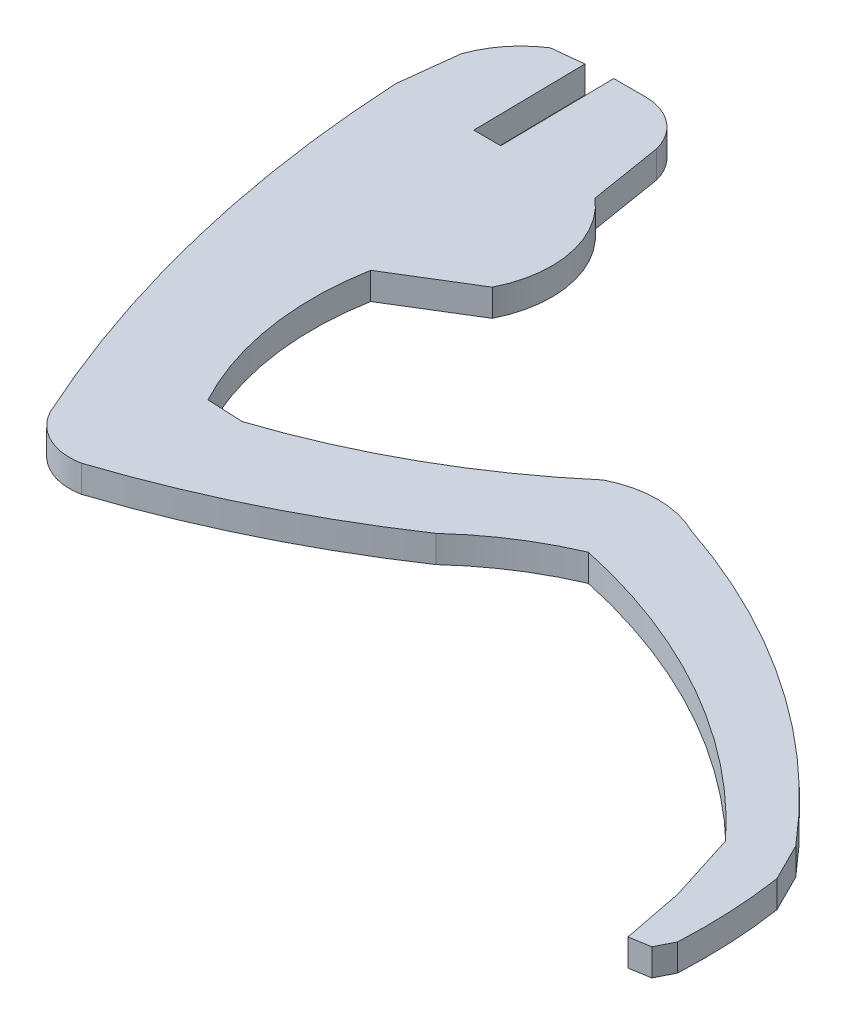
ISO-10303-21;
HEADER;
FILE_DESCRIPTION(('STEP AP214'),'2;1');
FILE_NAME('part.step','',(''),(''),'','','');
FILE_SCHEMA(('AUTOMOTIVE_DESIGN { 1 0 10303 214 1 1 1 1 }'));
ENDSEC;
DATA;
#1=APPLICATION_CONTEXT('core data for automotive mechanical design processes');
#2=APPLICATION_PROTOCOL_DEFINITION('international standard','automotive_design',2000,#1);
#3=PRODUCT_CONTEXT('',#1,'mechanical');
#4=PRODUCT('Part','Part','',(#3));
#5=PRODUCT_RELATED_PRODUCT_CATEGORY('part','',(#4));
#6=PRODUCT_DEFINITION_FORMATION('','',#4);
#7=PRODUCT_DEFINITION_CONTEXT('part definition',#1,'design');
#8=PRODUCT_DEFINITION('design','',#6,#7);
#9=PRODUCT_DEFINITION_SHAPE('','',#8);
#10=(LENGTH_UNIT() NAMED_UNIT(*) SI_UNIT(.MILLI.,.METRE.));
#11=(NAMED_UNIT(*) PLANE_ANGLE_UNIT() SI_UNIT($,.RADIAN.));
#12=(NAMED_UNIT(*) SI_UNIT($,.STERADIAN.) SOLID_ANGLE_UNIT());
#13=UNCERTAINTY_MEASURE_WITH_UNIT(LENGTH_MEASURE(1.E-05),#10,'distance_accuracy_value','');
#14=(GEOMETRIC_REPRESENTATION_CONTEXT(3) GLOBAL_UNCERTAINTY_ASSIGNED_CONTEXT((#13)) GLOBAL_UNIT_ASSIGNED_CONTEXT((#10,
#11,#12)) REPRESENTATION_CONTEXT('',''));
#15=CARTESIAN_POINT('',(0.,0.,0.));
#16=DIRECTION('',(0.,0.,1.));
#17=DIRECTION('',(1.,0.,0.));
#18=AXIS2_PLACEMENT_3D('',#15,#16,#17);
#19=CARTESIAN_POINT('',(-95.5605399999783,2.,-479.968799999999));
#20=DIRECTION('',(0.993149487101542,0.,0.116850743557512));
#21=DIRECTION('',(0.116850743557512,0.,-0.993149487101542));
#22=AXIS2_PLACEMENT_3D('',#19,#20,#21);
#23=PLANE('',#22);
#24=DIRECTION('',(-0.116850743557512,0.,0.993149487101542));
#25=VECTOR('',#24,1.);
#26=CARTESIAN_POINT('',(-95.5605399999783,0.,-479.968799999999));
#27=LINE('',#26,#25);
#28=CARTESIAN_POINT('',(-95.5605399999783,0.,-479.968799999999));
#29=VERTEX_POINT('',#28);
#30=CARTESIAN_POINT('',(-96.06745,0.,-475.66042));
#31=VERTEX_POINT('',#30);
#32=EDGE_CURVE('E11',#29,#31,#27,.T.);
#33=ORIENTED_EDGE('',*,*,#32,.T.);
#34=DIRECTION('',(0.,-1.,0.));
#35=VECTOR('',#34,1.);
#36=CARTESIAN_POINT('',(-96.06745,2.,-475.66042));
#37=LINE('',#36,#35);
#38=CARTESIAN_POINT('',(-96.06745,2.,-475.66042));
#39=VERTEX_POINT('',#38);
#40=EDGE_CURVE('E754',#39,#31,#37,.T.);
#41=ORIENTED_EDGE('',*,*,#40,.F.);
#42=DIRECTION('',(-0.116850743557512,0.,0.993149487101542));
#43=VECTOR('',#42,1.);
#44=CARTESIAN_POINT('',(-95.5605399999783,2.,-479.968799999999));
#45=LINE('',#44,#43);
#46=CARTESIAN_POINT('',(-95.5605399999783,2.,-479.968799999999));
#47=VERTEX_POINT('',#46);
#48=EDGE_CURVE('E41',#47,#39,#45,.T.);
#49=ORIENTED_EDGE('',*,*,#48,.F.);
#50=DIRECTION('',(0.,-1.,0.));
#51=VECTOR('',#50,1.);
#52=CARTESIAN_POINT('',(-95.5605399999783,2.,-479.968799999999));
#53=LINE('',#52,#51);
#54=EDGE_CURVE('E256',#47,#29,#53,.T.);
#55=ORIENTED_EDGE('',*,*,#54,.T.);
#56=EDGE_LOOP('',(#33,#41,#49,#55));
#57=FACE_BOUND('',#56,.T.);
#58=ADVANCED_FACE('F37',(#57),#23,.F.);
#59=CARTESIAN_POINT('',(-3.27849902421867,2.,-480.342685994515));
#60=DIRECTION('',(0.,-1.,0.));
#61=DIRECTION('',(0.,0.,-1.));
#62=AXIS2_PLACEMENT_3D('',#59,#60,#61);
#63=CYLINDRICAL_SURFACE('',#62,92.9070128571);
#64=CARTESIAN_POINT('',(-3.27849902421867,0.,-480.342685994515));
#65=DIRECTION('',(0.,1.,0.));
#66=DIRECTION('',(0.,0.,1.));
#67=AXIS2_PLACEMENT_3D('',#64,#65,#66);
#68=CIRCLE('',#67,92.9070128571);
#69=CARTESIAN_POINT('',(-87.8255699998963,0.,-441.826380000001));
#70=VERTEX_POINT('',#69);
#71=EDGE_CURVE('E47',#31,#70,#68,.T.);
#72=ORIENTED_EDGE('',*,*,#71,.T.);
#73=DIRECTION('',(0.,-1.,0.));
#74=VECTOR('',#73,1.);
#75=CARTESIAN_POINT('',(-87.8255699998963,2.,-441.826380000001));
#76=LINE('',#75,#74);
#77=CARTESIAN_POINT('',(-87.8255699998963,2.,-441.826380000001));
#78=VERTEX_POINT('',#77);
#79=EDGE_CURVE('E231',#78,#70,#76,.T.);
#80=ORIENTED_EDGE('',*,*,#79,.F.);
#81=CARTESIAN_POINT('',(-3.27849902421867,2.,-480.342685994515));
#82=DIRECTION('',(0.,1.,0.));
#83=DIRECTION('',(0.,0.,1.));
#84=AXIS2_PLACEMENT_3D('',#81,#82,#83);
#85=CIRCLE('',#84,92.9070128571);
#86=EDGE_CURVE('E140',#39,#78,#85,.T.);
#87=ORIENTED_EDGE('',*,*,#86,.F.);
#88=ORIENTED_EDGE('',*,*,#40,.T.);
#89=EDGE_LOOP('',(#72,#80,#87,#88));
#90=FACE_BOUND('',#89,.T.);
#91=ADVANCED_FACE('F530',(#90),#63,.T.);
#92=CARTESIAN_POINT('',(-84.1692994334178,2.,-443.709949724972));
#93=DIRECTION('',(0.,-1.,0.));
#94=DIRECTION('',(0.,0.,-1.));
#95=AXIS2_PLACEMENT_3D('',#92,#93,#94);
#96=CYLINDRICAL_SURFACE('',#95,4.11292467280005);
#97=CARTESIAN_POINT('',(-84.1692994334178,0.,-443.709949724972));
#98=DIRECTION('',(0.,1.,0.));
#99=DIRECTION('',(0.,0.,1.));
#100=AXIS2_PLACEMENT_3D('',#97,#98,#99);
#101=CIRCLE('',#100,4.11292467280005);
#102=CARTESIAN_POINT('',(-83.3874599998618,0.,-439.672019999945));
#103=VERTEX_POINT('',#102);
#104=EDGE_CURVE('E225',#70,#103,#101,.T.);
#105=ORIENTED_EDGE('',*,*,#104,.T.);
#106=DIRECTION('',(0.,-1.,0.));
#107=VECTOR('',#106,1.);
#108=CARTESIAN_POINT('',(-83.3874599998618,2.,-439.672019999945));
#109=LINE('',#108,#107);
#110=CARTESIAN_POINT('',(-83.3874599998618,2.,-439.672019999945));
#111=VERTEX_POINT('',#110);
#112=EDGE_CURVE('E229',#111,#103,#109,.T.);
#113=ORIENTED_EDGE('',*,*,#112,.F.);
#114=CARTESIAN_POINT('',(-84.1692994334178,2.,-443.709949724972));
#115=DIRECTION('',(0.,1.,0.));
#116=DIRECTION('',(0.,0.,1.));
#117=AXIS2_PLACEMENT_3D('',#114,#115,#116);
#118=CIRCLE('',#117,4.11292467280005);
#119=EDGE_CURVE('E305',#78,#111,#118,.T.);
#120=ORIENTED_EDGE('',*,*,#119,.F.);
#121=ORIENTED_EDGE('',*,*,#79,.T.);
#122=EDGE_LOOP('',(#105,#113,#120,#121));
#123=FACE_BOUND('',#122,.T.);
#124=ADVANCED_FACE('F227',(#123),#96,.T.);
#125=CARTESIAN_POINT('',(-105.814868184633,2.,-507.879840887424));
#126=DIRECTION('',(0.,-1.,0.));
#127=DIRECTION('',(0.,0.,-1.));
#128=AXIS2_PLACEMENT_3D('',#125,#126,#127);
#129=CYLINDRICAL_SURFACE('',#128,71.8003862671);
#130=CARTESIAN_POINT('',(-105.814868184633,0.,-507.879840887424));
#131=DIRECTION('',(0.,1.,0.));
#132=DIRECTION('',(0.,0.,1.));
#133=AXIS2_PLACEMENT_3D('',#130,#131,#132);
#134=CIRCLE('',#133,71.8003862671);
#135=CARTESIAN_POINT('',(-65.7618999998894,0.,-448.289110000005));
#136=VERTEX_POINT('',#135);
#137=EDGE_CURVE('E233',#103,#136,#134,.T.);
#138=ORIENTED_EDGE('',*,*,#137,.T.);
#139=DIRECTION('',(0.,-1.,0.));
#140=VECTOR('',#139,1.);
#141=CARTESIAN_POINT('',(-65.7618999998894,2.,-448.289110000005));
#142=LINE('',#141,#140);
#143=CARTESIAN_POINT('',(-65.7618999998894,2.,-448.289110000005));
#144=VERTEX_POINT('',#143);
#145=EDGE_CURVE('E241',#144,#136,#142,.T.);
#146=ORIENTED_EDGE('',*,*,#145,.F.);
#147=CARTESIAN_POINT('',(-105.814868184633,2.,-507.879840887424));
#148=DIRECTION('',(0.,1.,0.));
#149=DIRECTION('',(0.,0.,1.));
#150=AXIS2_PLACEMENT_3D('',#147,#148,#149);
#151=CIRCLE('',#150,71.8003862671);
#152=EDGE_CURVE('E240',#111,#144,#151,.T.);
#153=ORIENTED_EDGE('',*,*,#152,.F.);
#154=ORIENTED_EDGE('',*,*,#112,.T.);
#155=EDGE_LOOP('',(#138,#146,#153,#154));
#156=FACE_BOUND('',#155,.T.);
#157=ADVANCED_FACE('F237',(#156),#129,.T.);
#158=CARTESIAN_POINT('',(-49.4435821565631,2.,-430.598388603145));
#159=DIRECTION('',(0.,-1.,0.));
#160=DIRECTION('',(0.,0.,-1.));
#161=AXIS2_PLACEMENT_3D('',#158,#159,#160);
#162=CYLINDRICAL_SURFACE('',#161,24.0675948274265);
#163=CARTESIAN_POINT('',(-49.4435821565631,0.,-430.598388603145));
#164=DIRECTION('',(0.,1.,0.));
#165=DIRECTION('',(0.,0.,1.));
#166=AXIS2_PLACEMENT_3D('',#163,#164,#165);
#167=CIRCLE('',#166,24.0675948274265);
#168=CARTESIAN_POINT('',(-58.9144399999288,0.,-452.724210000054));
#169=VERTEX_POINT('',#168);
#170=EDGE_CURVE('E246',#169,#136,#167,.T.);
#171=ORIENTED_EDGE('',*,*,#170,.F.);
#172=DIRECTION('',(0.,-1.,0.));
#173=VECTOR('',#172,1.);
#174=CARTESIAN_POINT('',(-58.9144399999288,2.,-452.724210000054));
#175=LINE('',#174,#173);
#176=CARTESIAN_POINT('',(-58.9144399999288,2.,-452.724210000054));
#177=VERTEX_POINT('',#176);
#178=EDGE_CURVE('E362',#177,#169,#175,.T.);
#179=ORIENTED_EDGE('',*,*,#178,.F.);
#180=CARTESIAN_POINT('',(-49.4435821565631,2.,-430.598388603145));
#181=DIRECTION('',(0.,1.,0.));
#182=DIRECTION('',(0.,0.,1.));
#183=AXIS2_PLACEMENT_3D('',#180,#181,#182);
#184=CIRCLE('',#183,24.0675948274265);
#185=EDGE_CURVE('E301',#177,#144,#184,.T.);
#186=ORIENTED_EDGE('',*,*,#185,.T.);
#187=ORIENTED_EDGE('',*,*,#145,.T.);
#188=EDGE_LOOP('',(#171,#179,#186,#187));
#189=FACE_BOUND('',#188,.T.);
#190=ADVANCED_FACE('F367',(#189),#162,.F.);
#191=CARTESIAN_POINT('',(-68.4026271484373,2.,-408.642788376018));
#192=DIRECTION('',(0.,-1.,0.));
#193=DIRECTION('',(0.,0.,-1.));
#194=AXIS2_PLACEMENT_3D('',#191,#192,#193);
#195=CYLINDRICAL_SURFACE('',#194,45.0909905387001);
#196=CARTESIAN_POINT('',(-68.4026271484373,0.,-408.642788376018));
#197=DIRECTION('',(0.,1.,0.));
#198=DIRECTION('',(0.,0.,1.));
#199=AXIS2_PLACEMENT_3D('',#196,#197,#198);
#200=CIRCLE('',#199,45.0909905387001);
#201=CARTESIAN_POINT('',(-35.3294799998825,0.,-439.291840000027));
#202=VERTEX_POINT('',#201);
#203=EDGE_CURVE('E248',#202,#169,#200,.T.);
#204=ORIENTED_EDGE('',*,*,#203,.F.);
#205=DIRECTION('',(0.,-1.,0.));
#206=VECTOR('',#205,1.);
#207=CARTESIAN_POINT('',(-35.3294799998825,2.,-439.291840000027));
#208=LINE('',#207,#206);
#209=CARTESIAN_POINT('',(-35.3294799998825,2.,-439.291840000027));
#210=VERTEX_POINT('',#209);
#211=EDGE_CURVE('E360',#210,#202,#208,.T.);
#212=ORIENTED_EDGE('',*,*,#211,.F.);
#213=CARTESIAN_POINT('',(-68.4026271484373,2.,-408.642788376018));
#214=DIRECTION('',(0.,1.,0.));
#215=DIRECTION('',(0.,0.,1.));
#216=AXIS2_PLACEMENT_3D('',#213,#214,#215);
#217=CIRCLE('',#216,45.0909905387001);
#218=EDGE_CURVE('E298',#210,#177,#217,.T.);
#219=ORIENTED_EDGE('',*,*,#218,.T.);
#220=ORIENTED_EDGE('',*,*,#178,.T.);
#221=EDGE_LOOP('',(#204,#212,#219,#220));
#222=FACE_BOUND('',#221,.T.);
#223=ADVANCED_FACE('F359',(#222),#195,.F.);
#224=CARTESIAN_POINT('',(-35.3294799998825,2.,-439.291840000027));
#225=DIRECTION('',(0.95318750378042,0.,-0.302379864800639));
#226=DIRECTION('',(-0.302379864800639,0.,-0.95318750378042));
#227=AXIS2_PLACEMENT_3D('',#224,#225,#226);
#228=PLANE('',#227);
#229=DIRECTION('',(0.302379864800639,0.,0.95318750378042));
#230=VECTOR('',#229,1.);
#231=CARTESIAN_POINT('',(-35.3294799998825,0.,-439.291840000027));
#232=LINE('',#231,#230);
#233=CARTESIAN_POINT('',(-33.6813199999373,0.,-434.096370000018));
#234=VERTEX_POINT('',#233);
#235=EDGE_CURVE('E354',#202,#234,#232,.T.);
#236=ORIENTED_EDGE('',*,*,#235,.T.);
#237=DIRECTION('',(0.,-1.,0.));
#238=VECTOR('',#237,1.);
#239=CARTESIAN_POINT('',(-33.6813199999373,2.,-434.096370000018));
#240=LINE('',#239,#238);
#241=CARTESIAN_POINT('',(-33.6813199999373,2.,-434.096370000018));
#242=VERTEX_POINT('',#241);
#243=EDGE_CURVE('E372',#242,#234,#240,.T.);
#244=ORIENTED_EDGE('',*,*,#243,.F.);
#245=DIRECTION('',(0.302379864800639,0.,0.95318750378042));
#246=VECTOR('',#245,1.);
#247=CARTESIAN_POINT('',(-35.3294799998825,2.,-439.291840000027));
#248=LINE('',#247,#246);
#249=EDGE_CURVE('E296',#210,#242,#248,.T.);
#250=ORIENTED_EDGE('',*,*,#249,.F.);
#251=ORIENTED_EDGE('',*,*,#211,.T.);
#252=EDGE_LOOP('',(#236,#244,#250,#251));
#253=FACE_BOUND('',#252,.T.);
#254=ADVANCED_FACE('F521',(#253),#228,.F.);
#255=CARTESIAN_POINT('',(-33.6813199999373,2.,-434.096370000018));
#256=DIRECTION('',(0.98157353973626,0.,-0.191084761531707));
#257=DIRECTION('',(-0.191084761531707,0.,-0.98157353973626));
#258=AXIS2_PLACEMENT_3D('',#255,#256,#257);
#259=PLANE('',#258);
#260=DIRECTION('',(0.191084761531707,0.,0.98157353973626));
#261=VECTOR('',#260,1.);
#262=CARTESIAN_POINT('',(-33.6813199999373,0.,-434.096370000018));
#263=LINE('',#262,#261);
#264=CARTESIAN_POINT('',(-32.7932599999372,0.,-429.534540000018));
#265=VERTEX_POINT('',#264);
#266=EDGE_CURVE('E352',#234,#265,#263,.T.);
#267=ORIENTED_EDGE('',*,*,#266,.T.);
#268=DIRECTION('',(0.,-1.,0.));
#269=VECTOR('',#268,1.);
#270=CARTESIAN_POINT('',(-32.7932599999372,2.,-429.534540000018));
#271=LINE('',#270,#269);
#272=CARTESIAN_POINT('',(-32.7932599999372,2.,-429.534540000018));
#273=VERTEX_POINT('',#272);
#274=EDGE_CURVE('E375',#273,#265,#271,.T.);
#275=ORIENTED_EDGE('',*,*,#274,.F.);
#276=DIRECTION('',(0.191084761531707,0.,0.98157353973626));
#277=VECTOR('',#276,1.);
#278=CARTESIAN_POINT('',(-33.6813199999373,2.,-434.096370000018));
#279=LINE('',#278,#277);
#280=EDGE_CURVE('E294',#242,#273,#279,.T.);
#281=ORIENTED_EDGE('',*,*,#280,.F.);
#282=ORIENTED_EDGE('',*,*,#243,.T.);
#283=EDGE_LOOP('',(#267,#275,#281,#282));
#284=FACE_BOUND('',#283,.T.);
#285=ADVANCED_FACE('F518',(#284),#259,.F.);
#286=CARTESIAN_POINT('',(-32.7932599999372,2.,-429.534540000018));
#287=DIRECTION('',(-0.164343259760888,0.,-0.986403210138311));
#288=DIRECTION('',(-0.986403210138311,0.,0.164343259760888));
#289=AXIS2_PLACEMENT_3D('',#286,#287,#288);
#290=PLANE('',#289);
#291=DIRECTION('',(0.986403210138311,0.,-0.164343259760888));
#292=VECTOR('',#291,1.);
#293=CARTESIAN_POINT('',(-32.7932599999372,0.,-429.534540000018));
#294=LINE('',#293,#292);
#295=CARTESIAN_POINT('',(-31.2719699999373,0.,-429.788000000018));
#296=VERTEX_POINT('',#295);
#297=EDGE_CURVE('E350',#265,#296,#294,.T.);
#298=ORIENTED_EDGE('',*,*,#297,.T.);
#299=DIRECTION('',(0.,-1.,0.));
#300=VECTOR('',#299,1.);
#301=CARTESIAN_POINT('',(-31.2719699999373,2.,-429.788000000018));
#302=LINE('',#301,#300);
#303=CARTESIAN_POINT('',(-31.2719699999373,2.,-429.788000000018));
#304=VERTEX_POINT('',#303);
#305=EDGE_CURVE('E378',#304,#296,#302,.T.);
#306=ORIENTED_EDGE('',*,*,#305,.F.);
#307=DIRECTION('',(0.986403210138311,0.,-0.164343259760888));
#308=VECTOR('',#307,1.);
#309=CARTESIAN_POINT('',(-32.7932599999372,2.,-429.534540000018));
#310=LINE('',#309,#308);
#311=EDGE_CURVE('E292',#273,#304,#310,.T.);
#312=ORIENTED_EDGE('',*,*,#311,.F.);
#313=ORIENTED_EDGE('',*,*,#274,.T.);
#314=EDGE_LOOP('',(#298,#306,#312,#313));
#315=FACE_BOUND('',#314,.T.);
#316=ADVANCED_FACE('F514',(#315),#290,.F.);
#317=CARTESIAN_POINT('',(-31.2719699999373,2.,-429.788000000018));
#318=DIRECTION('',(-0.89423093823168,0.,-0.447605885918951));
#319=DIRECTION('',(-0.447605885918951,0.,0.89423093823168));
#320=AXIS2_PLACEMENT_3D('',#317,#318,#319);
#321=PLANE('',#320);
#322=DIRECTION('',(0.447605885918951,0.,-0.89423093823168));
#323=VECTOR('',#322,1.);
#324=CARTESIAN_POINT('',(-31.2719699999373,0.,-429.788000000018));
#325=LINE('',#324,#323);
#326=CARTESIAN_POINT('',(-30.6376399999373,0.,-431.055270000018));
#327=VERTEX_POINT('',#326);
#328=EDGE_CURVE('E348',#296,#327,#325,.T.);
#329=ORIENTED_EDGE('',*,*,#328,.T.);
#330=DIRECTION('',(0.,-1.,0.));
#331=VECTOR('',#330,1.);
#332=CARTESIAN_POINT('',(-30.6376399999373,2.,-431.055270000018));
#333=LINE('',#332,#331);
#334=CARTESIAN_POINT('',(-30.6376399999373,2.,-431.055270000018));
#335=VERTEX_POINT('',#334);
#336=EDGE_CURVE('E381',#335,#327,#333,.T.);
#337=ORIENTED_EDGE('',*,*,#336,.F.);
#338=DIRECTION('',(0.447605885918951,0.,-0.89423093823168));
#339=VECTOR('',#338,1.);
#340=CARTESIAN_POINT('',(-31.2719699999373,2.,-429.788000000018));
#341=LINE('',#340,#339);
#342=EDGE_CURVE('E290',#304,#335,#341,.T.);
#343=ORIENTED_EDGE('',*,*,#342,.F.);
#344=ORIENTED_EDGE('',*,*,#305,.T.);
#345=EDGE_LOOP('',(#329,#337,#343,#344));
#346=FACE_BOUND('',#345,.T.);
#347=ADVANCED_FACE('F509',(#346),#321,.F.);
#348=CARTESIAN_POINT('',(-69.4354700532237,2.,-433.019361081627));
#349=DIRECTION('',(0.,-1.,0.));
#350=DIRECTION('',(0.,0.,-1.));
#351=AXIS2_PLACEMENT_3D('',#348,#349,#350);
#352=CYLINDRICAL_SURFACE('',#351,38.8475130558);
#353=CARTESIAN_POINT('',(-69.4354700532237,0.,-433.019361081627));
#354=DIRECTION('',(0.,1.,0.));
#355=DIRECTION('',(0.,0.,1.));
#356=AXIS2_PLACEMENT_3D('',#353,#354,#355);
#357=CIRCLE('',#356,38.8475130558);
#358=CARTESIAN_POINT('',(-31.0182399999589,0.,-438.78527000001));
#359=VERTEX_POINT('',#358);
#360=EDGE_CURVE('E346',#327,#359,#357,.T.);
#361=ORIENTED_EDGE('',*,*,#360,.T.);
#362=DIRECTION('',(0.,-1.,0.));
#363=VECTOR('',#362,1.);
#364=CARTESIAN_POINT('',(-31.0182399999589,2.,-438.78527000001));
#365=LINE('',#364,#363);
#366=CARTESIAN_POINT('',(-31.0182399999589,2.,-438.78527000001));
#367=VERTEX_POINT('',#366);
#368=EDGE_CURVE('E384',#367,#359,#365,.T.);
#369=ORIENTED_EDGE('',*,*,#368,.F.);
#370=CARTESIAN_POINT('',(-69.4354700532237,2.,-433.019361081627));
#371=DIRECTION('',(0.,1.,0.));
#372=DIRECTION('',(0.,0.,1.));
#373=AXIS2_PLACEMENT_3D('',#370,#371,#372);
#374=CIRCLE('',#373,38.8475130558);
#375=EDGE_CURVE('E288',#335,#367,#374,.T.);
#376=ORIENTED_EDGE('',*,*,#375,.F.);
#377=ORIENTED_EDGE('',*,*,#336,.T.);
#378=EDGE_LOOP('',(#361,#369,#376,#377));
#379=FACE_BOUND('',#378,.T.);
#380=ADVANCED_FACE('F504',(#379),#352,.T.);
#381=CARTESIAN_POINT('',(-31.0182399999589,2.,-438.78527000001));
#382=DIRECTION('',(-0.894280215987796,0.,0.447507424846583));
#383=DIRECTION('',(0.447507424846583,0.,0.894280215987796));
#384=AXIS2_PLACEMENT_3D('',#381,#382,#383);
#385=PLANE('',#384);
#386=DIRECTION('',(-0.447507424846583,0.,-0.894280215987796));
#387=VECTOR('',#386,1.);
#388=CARTESIAN_POINT('',(-31.0182399999589,0.,-438.78527000001));
#389=LINE('',#388,#387);
#390=CARTESIAN_POINT('',(-32.4132099999372,0.,-441.572920000018));
#391=VERTEX_POINT('',#390);
#392=EDGE_CURVE('E344',#359,#391,#389,.T.);
#393=ORIENTED_EDGE('',*,*,#392,.T.);
#394=DIRECTION('',(0.,-1.,0.));
#395=VECTOR('',#394,1.);
#396=CARTESIAN_POINT('',(-32.4132099999372,2.,-441.572920000018));
#397=LINE('',#396,#395);
#398=CARTESIAN_POINT('',(-32.4132099999372,2.,-441.572920000018));
#399=VERTEX_POINT('',#398);
#400=EDGE_CURVE('E387',#399,#391,#397,.T.);
#401=ORIENTED_EDGE('',*,*,#400,.F.);
#402=DIRECTION('',(-0.447507424846583,0.,-0.894280215987796));
#403=VECTOR('',#402,1.);
#404=CARTESIAN_POINT('',(-31.0182399999589,2.,-438.78527000001));
#405=LINE('',#404,#403);
#406=EDGE_CURVE('E286',#367,#399,#405,.T.);
#407=ORIENTED_EDGE('',*,*,#406,.F.);
#408=ORIENTED_EDGE('',*,*,#368,.T.);
#409=EDGE_LOOP('',(#393,#401,#407,#408));
#410=FACE_BOUND('',#409,.T.);
#411=ADVANCED_FACE('F500',(#410),#385,.F.);
#412=CARTESIAN_POINT('',(-73.6546728962411,2.,-406.717285180119));
#413=DIRECTION('',(0.,-1.,0.));
#414=DIRECTION('',(0.,0.,-1.));
#415=AXIS2_PLACEMENT_3D('',#412,#413,#414);
#416=CYLINDRICAL_SURFACE('',#415,53.9979031123);
#417=CARTESIAN_POINT('',(-73.6546728962411,0.,-406.717285180119));
#418=DIRECTION('',(0.,1.,0.));
#419=DIRECTION('',(0.,0.,1.));
#420=AXIS2_PLACEMENT_3D('',#417,#418,#419);
#421=CIRCLE('',#420,53.9979031123);
#422=CARTESIAN_POINT('',(-56.5056399999403,0.,-457.919670000037));
#423=VERTEX_POINT('',#422);
#424=EDGE_CURVE('E342',#391,#423,#421,.T.);
#425=ORIENTED_EDGE('',*,*,#424,.T.);
#426=DIRECTION('',(0.,-1.,0.));
#427=VECTOR('',#426,1.);
#428=CARTESIAN_POINT('',(-56.5056399999403,2.,-457.919670000037));
#429=LINE('',#428,#427);
#430=CARTESIAN_POINT('',(-56.5056399999403,2.,-457.919670000037));
#431=VERTEX_POINT('',#430);
#432=EDGE_CURVE('E390',#431,#423,#429,.T.);
#433=ORIENTED_EDGE('',*,*,#432,.F.);
#434=CARTESIAN_POINT('',(-73.6546728962411,2.,-406.717285180119));
#435=DIRECTION('',(0.,1.,0.));
#436=DIRECTION('',(0.,0.,1.));
#437=AXIS2_PLACEMENT_3D('',#434,#435,#436);
#438=CIRCLE('',#437,53.9979031123);
#439=EDGE_CURVE('E284',#399,#431,#438,.T.);
#440=ORIENTED_EDGE('',*,*,#439,.F.);
#441=ORIENTED_EDGE('',*,*,#400,.T.);
#442=EDGE_LOOP('',(#425,#433,#440,#441));
#443=FACE_BOUND('',#442,.T.);
#444=ADVANCED_FACE('F495',(#443),#416,.T.);
#445=CARTESIAN_POINT('',(-59.7390699998927,2.,-451.42743000004));
#446=DIRECTION('',(0.,-1.,0.));
#447=DIRECTION('',(0.,0.,-1.));
#448=AXIS2_PLACEMENT_3D('',#445,#446,#447);
#449=CYLINDRICAL_SURFACE('',#448,7.25287872380002);
#450=CARTESIAN_POINT('',(-59.7390699998927,0.,-451.42743000004));
#451=DIRECTION('',(0.,1.,0.));
#452=DIRECTION('',(0.,0.,1.));
#453=AXIS2_PLACEMENT_3D('',#450,#451,#452);
#454=CIRCLE('',#453,7.25287872380002);
#455=CARTESIAN_POINT('',(-62.9724999999275,0.,-457.919669999996));
#456=VERTEX_POINT('',#455);
#457=EDGE_CURVE('E339',#423,#456,#454,.T.);
#458=ORIENTED_EDGE('',*,*,#457,.T.);
#459=DIRECTION('',(0.,-1.,0.));
#460=VECTOR('',#459,1.);
#461=CARTESIAN_POINT('',(-62.9724999999275,2.,-457.919669999996));
#462=LINE('',#461,#460);
#463=CARTESIAN_POINT('',(-62.9724999999275,2.,-457.919669999996));
#464=VERTEX_POINT('',#463);
#465=EDGE_CURVE('E393',#464,#456,#462,.T.);
#466=ORIENTED_EDGE('',*,*,#465,.F.);
#467=CARTESIAN_POINT('',(-59.7390699998927,2.,-451.42743000004));
#468=DIRECTION('',(0.,1.,0.));
#469=DIRECTION('',(0.,0.,1.));
#470=AXIS2_PLACEMENT_3D('',#467,#468,#469);
#471=CIRCLE('',#470,7.25287872380002);
#472=EDGE_CURVE('E282',#431,#464,#471,.T.);
#473=ORIENTED_EDGE('',*,*,#472,.F.);
#474=ORIENTED_EDGE('',*,*,#432,.T.);
#475=EDGE_LOOP('',(#458,#466,#473,#474));
#476=FACE_BOUND('',#475,.T.);
#477=ADVANCED_FACE('F489',(#476),#449,.T.);
#478=CARTESIAN_POINT('',(-96.006806198349,2.,-496.608597764732));
#479=DIRECTION('',(0.,-1.,0.));
#480=DIRECTION('',(0.,0.,-1.));
#481=AXIS2_PLACEMENT_3D('',#478,#479,#480);
#482=CYLINDRICAL_SURFACE('',#481,50.8733576402818);
#483=CARTESIAN_POINT('',(-96.006806198349,0.,-496.608597764732));
#484=DIRECTION('',(0.,1.,0.));
#485=DIRECTION('',(0.,0.,1.));
#486=AXIS2_PLACEMENT_3D('',#483,#484,#485);
#487=CIRCLE('',#486,50.8733576402818);
#488=CARTESIAN_POINT('',(-80.0905999999178,0.,-448.289110000011));
#489=VERTEX_POINT('',#488);
#490=EDGE_CURVE('E336',#489,#456,#487,.T.);
#491=ORIENTED_EDGE('',*,*,#490,.F.);
#492=DIRECTION('',(0.,-1.,0.));
#493=VECTOR('',#492,1.);
#494=CARTESIAN_POINT('',(-80.0905999999178,2.,-448.289110000011));
#495=LINE('',#494,#493);
#496=CARTESIAN_POINT('',(-80.0905999999178,2.,-448.289110000011));
#497=VERTEX_POINT('',#496);
#498=EDGE_CURVE('E395',#497,#489,#495,.T.);
#499=ORIENTED_EDGE('',*,*,#498,.F.);
#500=CARTESIAN_POINT('',(-96.006806198349,2.,-496.608597764732));
#501=DIRECTION('',(0.,1.,0.));
#502=DIRECTION('',(0.,0.,1.));
#503=AXIS2_PLACEMENT_3D('',#500,#501,#502);
#504=CIRCLE('',#503,50.8733576402818);
#505=EDGE_CURVE('E279',#497,#464,#504,.T.);
#506=ORIENTED_EDGE('',*,*,#505,.T.);
#507=ORIENTED_EDGE('',*,*,#465,.T.);
#508=EDGE_LOOP('',(#491,#499,#506,#507));
#509=FACE_BOUND('',#508,.T.);
#510=ADVANCED_FACE('F484',(#509),#482,.F.);
#511=CARTESIAN_POINT('',(-80.0905999999178,2.,-448.289110000011));
#512=DIRECTION('',(-0.0475437603254913,0.,0.998869156023006));
#513=DIRECTION('',(0.998869156023006,0.,0.0475437603254913));
#514=AXIS2_PLACEMENT_3D('',#511,#512,#513);
#515=PLANE('',#514);
#516=DIRECTION('',(-0.998869156023006,0.,-0.0475437603254913));
#517=VECTOR('',#516,1.);
#518=CARTESIAN_POINT('',(-80.0905999999178,0.,-448.289110000011));
#519=LINE('',#518,#517);
#520=CARTESIAN_POINT('',(-82.7531299999547,0.,-448.415840000049));
#521=VERTEX_POINT('',#520);
#522=EDGE_CURVE('E333',#489,#521,#519,.T.);
#523=ORIENTED_EDGE('',*,*,#522,.T.);
#524=DIRECTION('',(0.,-1.,0.));
#525=VECTOR('',#524,1.);
#526=CARTESIAN_POINT('',(-82.7531299999547,2.,-448.415840000049));
#527=LINE('',#526,#525);
#528=CARTESIAN_POINT('',(-82.7531299999547,2.,-448.415840000049));
#529=VERTEX_POINT('',#528);
#530=EDGE_CURVE('E397',#529,#521,#527,.T.);
#531=ORIENTED_EDGE('',*,*,#530,.F.);
#532=DIRECTION('',(-0.998869156023006,0.,-0.0475437603254913));
#533=VECTOR('',#532,1.);
#534=CARTESIAN_POINT('',(-80.0905999999178,2.,-448.289110000011));
#535=LINE('',#534,#533);
#536=EDGE_CURVE('E277',#497,#529,#535,.T.);
#537=ORIENTED_EDGE('',*,*,#536,.F.);
#538=ORIENTED_EDGE('',*,*,#498,.T.);
#539=EDGE_LOOP('',(#523,#531,#537,#538));
#540=FACE_BOUND('',#539,.T.);
#541=ADVANCED_FACE('F480',(#540),#515,.F.);
#542=CARTESIAN_POINT('',(-63.4609807686761,2.,-458.832514822638));
#543=DIRECTION('',(0.,-1.,0.));
#544=DIRECTION('',(0.,0.,-1.));
#545=AXIS2_PLACEMENT_3D('',#542,#543,#544);
#546=CYLINDRICAL_SURFACE('',#545,21.9247379989243);
#547=CARTESIAN_POINT('',(-63.4609807686761,0.,-458.832514822638));
#548=DIRECTION('',(0.,1.,0.));
#549=DIRECTION('',(0.,0.,1.));
#550=AXIS2_PLACEMENT_3D('',#547,#548,#549);
#551=CIRCLE('',#550,21.9247379989243);
#552=CARTESIAN_POINT('',(-85.0356199999397,0.,-462.734959999997));
#553=VERTEX_POINT('',#552);
#554=EDGE_CURVE('E330',#553,#521,#551,.T.);
#555=ORIENTED_EDGE('',*,*,#554,.F.);
#556=DIRECTION('',(0.,-1.,0.));
#557=VECTOR('',#556,1.);
#558=CARTESIAN_POINT('',(-85.0356199999397,2.,-462.734959999997));
#559=LINE('',#558,#557);
#560=CARTESIAN_POINT('',(-85.0356199999397,2.,-462.734959999997));
#561=VERTEX_POINT('',#560);
#562=EDGE_CURVE('E399',#561,#553,#559,.T.);
#563=ORIENTED_EDGE('',*,*,#562,.F.);
#564=CARTESIAN_POINT('',(-63.4609807686761,2.,-458.832514822638));
#565=DIRECTION('',(0.,1.,0.));
#566=DIRECTION('',(0.,0.,1.));
#567=AXIS2_PLACEMENT_3D('',#564,#565,#566);
#568=CIRCLE('',#567,21.9247379989243);
#569=EDGE_CURVE('E274',#561,#529,#568,.T.);
#570=ORIENTED_EDGE('',*,*,#569,.T.);
#571=ORIENTED_EDGE('',*,*,#530,.T.);
#572=EDGE_LOOP('',(#555,#563,#570,#571));
#573=FACE_BOUND('',#572,.T.);
#574=ADVANCED_FACE('F476',(#573),#546,.F.);
#575=CARTESIAN_POINT('',(-85.0356199999397,2.,-462.734959999997));
#576=DIRECTION('',(-0.522785915398173,0.,-0.852464009012283));
#577=DIRECTION('',(-0.852464009012283,0.,0.522785915398173));
#578=AXIS2_PLACEMENT_3D('',#575,#576,#577);
#579=PLANE('',#578);
#580=DIRECTION('',(0.852464009012283,0.,-0.522785915398173));
#581=VECTOR('',#580,1.);
#582=CARTESIAN_POINT('',(-85.0356199999397,0.,-462.734959999997));
#583=LINE('',#582,#581);
#584=CARTESIAN_POINT('',(-79.45682,0.,-466.156240000042));
#585=VERTEX_POINT('',#584);
#586=EDGE_CURVE('E328',#553,#585,#583,.T.);
#587=ORIENTED_EDGE('',*,*,#586,.T.);
#588=DIRECTION('',(0.,-1.,0.));
#589=VECTOR('',#588,1.);
#590=CARTESIAN_POINT('',(-79.45682,2.,-466.156240000042));
#591=LINE('',#590,#589);
#592=CARTESIAN_POINT('',(-79.45682,2.,-466.156240000042));
#593=VERTEX_POINT('',#592);
#594=EDGE_CURVE('E401',#593,#585,#591,.T.);
#595=ORIENTED_EDGE('',*,*,#594,.F.);
#596=DIRECTION('',(0.852464009012283,0.,-0.522785915398173));
#597=VECTOR('',#596,1.);
#598=CARTESIAN_POINT('',(-85.0356199999397,2.,-462.734959999997));
#599=LINE('',#598,#597);
#600=EDGE_CURVE('E272',#561,#593,#599,.T.);
#601=ORIENTED_EDGE('',*,*,#600,.F.);
#602=ORIENTED_EDGE('',*,*,#562,.T.);
#603=EDGE_LOOP('',(#587,#595,#601,#602));
#604=FACE_BOUND('',#603,.T.);
#605=ADVANCED_FACE('F471',(#604),#579,.F.);
#606=CARTESIAN_POINT('',(-86.4424295698578,2.,-469.700727850391));
#607=DIRECTION('',(0.,-1.,0.));
#608=DIRECTION('',(0.,0.,-1.));
#609=AXIS2_PLACEMENT_3D('',#606,#607,#608);
#610=CYLINDRICAL_SURFACE('',#609,7.83339869940003);
#611=CARTESIAN_POINT('',(-86.4424295698578,0.,-469.700727850391));
#612=DIRECTION('',(0.,1.,0.));
#613=DIRECTION('',(0.,0.,1.));
#614=AXIS2_PLACEMENT_3D('',#611,#612,#613);
#615=CIRCLE('',#614,7.83339869940003);
#616=CARTESIAN_POINT('',(-81.3587099999503,0.,-475.660420000016));
#617=VERTEX_POINT('',#616);
#618=EDGE_CURVE('E326',#585,#617,#615,.T.);
#619=ORIENTED_EDGE('',*,*,#618,.T.);
#620=DIRECTION('',(0.,-1.,0.));
#621=VECTOR('',#620,1.);
#622=CARTESIAN_POINT('',(-81.3587099999503,2.,-475.660420000016));
#623=LINE('',#622,#621);
#624=CARTESIAN_POINT('',(-81.3587099999503,2.,-475.660420000016));
#625=VERTEX_POINT('',#624);
#626=EDGE_CURVE('E404',#625,#617,#623,.T.);
#627=ORIENTED_EDGE('',*,*,#626,.F.);
#628=CARTESIAN_POINT('',(-86.4424295698578,2.,-469.700727850391));
#629=DIRECTION('',(0.,1.,0.));
#630=DIRECTION('',(0.,0.,1.));
#631=AXIS2_PLACEMENT_3D('',#628,#629,#630);
#632=CIRCLE('',#631,7.83339869940003);
#633=EDGE_CURVE('E270',#593,#625,#632,.T.);
#634=ORIENTED_EDGE('',*,*,#633,.F.);
#635=ORIENTED_EDGE('',*,*,#594,.T.);
#636=EDGE_LOOP('',(#619,#627,#634,#635));
#637=FACE_BOUND('',#636,.T.);
#638=ADVANCED_FACE('F467',(#637),#610,.T.);
#639=CARTESIAN_POINT('',(-81.3587099999503,2.,-475.660420000016));
#640=DIRECTION('',(-0.986991986348394,0.,0.160769458803755));
#641=DIRECTION('',(0.160769458803755,0.,0.986991986348394));
#642=AXIS2_PLACEMENT_3D('',#639,#640,#641);
#643=PLANE('',#642);
#644=DIRECTION('',(-0.160769458803755,0.,-0.986991986348394));
#645=VECTOR('',#644,1.);
#646=CARTESIAN_POINT('',(-81.3587099999503,0.,-475.660420000016));
#647=LINE('',#646,#645);
#648=CARTESIAN_POINT('',(-82.24622,0.,-481.109000000042));
#649=VERTEX_POINT('',#648);
#650=EDGE_CURVE('E324',#617,#649,#647,.T.);
#651=ORIENTED_EDGE('',*,*,#650,.T.);
#652=DIRECTION('',(0.,-1.,0.));
#653=VECTOR('',#652,1.);
#654=CARTESIAN_POINT('',(-82.24622,2.,-481.109000000042));
#655=LINE('',#654,#653);
#656=CARTESIAN_POINT('',(-82.24622,2.,-481.109000000042));
#657=VERTEX_POINT('',#656);
#658=EDGE_CURVE('E407',#657,#649,#655,.T.);
#659=ORIENTED_EDGE('',*,*,#658,.F.);
#660=DIRECTION('',(-0.160769458803755,0.,-0.986991986348394));
#661=VECTOR('',#660,1.);
#662=CARTESIAN_POINT('',(-81.3587099999503,2.,-475.660420000016));
#663=LINE('',#662,#661);
#664=EDGE_CURVE('E268',#625,#657,#663,.T.);
#665=ORIENTED_EDGE('',*,*,#664,.F.);
#666=ORIENTED_EDGE('',*,*,#626,.T.);
#667=EDGE_LOOP('',(#651,#659,#665,#666));
#668=FACE_BOUND('',#667,.T.);
#669=ADVANCED_FACE('F462',(#668),#643,.F.);
#670=CARTESIAN_POINT('',(-86.0027012687552,2.,-480.146761005641));
#671=DIRECTION('',(0.,-1.,0.));
#672=DIRECTION('',(0.,0.,-1.));
#673=AXIS2_PLACEMENT_3D('',#670,#671,#672);
#674=CYLINDRICAL_SURFACE('',#673,3.87776422760002);
#675=CARTESIAN_POINT('',(-86.0027012687552,0.,-480.146761005641));
#676=DIRECTION('',(0.,1.,0.));
#677=DIRECTION('',(0.,0.,1.));
#678=AXIS2_PLACEMENT_3D('',#675,#676,#677);
#679=CIRCLE('',#678,3.87776422760002);
#680=CARTESIAN_POINT('',(-85.9236800000168,0.,-484.02372));
#681=VERTEX_POINT('',#680);
#682=EDGE_CURVE('E322',#649,#681,#679,.T.);
#683=ORIENTED_EDGE('',*,*,#682,.T.);
#684=DIRECTION('',(0.,-1.,0.));
#685=VECTOR('',#684,1.);
#686=CARTESIAN_POINT('',(-85.9236800000168,2.,-484.02372));
#687=LINE('',#686,#685);
#688=CARTESIAN_POINT('',(-85.9236800000168,2.,-484.02372));
#689=VERTEX_POINT('',#688);
#690=EDGE_CURVE('E410',#689,#681,#687,.T.);
#691=ORIENTED_EDGE('',*,*,#690,.F.);
#692=CARTESIAN_POINT('',(-86.0027012687552,2.,-480.146761005641));
#693=DIRECTION('',(0.,1.,0.));
#694=DIRECTION('',(0.,0.,1.));
#695=AXIS2_PLACEMENT_3D('',#692,#693,#694);
#696=CIRCLE('',#695,3.87776422760002);
#697=EDGE_CURVE('E266',#657,#689,#696,.T.);
#698=ORIENTED_EDGE('',*,*,#697,.F.);
#699=ORIENTED_EDGE('',*,*,#658,.T.);
#700=EDGE_LOOP('',(#683,#691,#698,#699));
#701=FACE_BOUND('',#700,.T.);
#702=ADVANCED_FACE('F456',(#701),#674,.T.);
#703=CARTESIAN_POINT('',(-85.9236800000168,2.,-484.02372));
#704=DIRECTION('',(0.,0.,1.));
#705=DIRECTION('',(1.,0.,0.));
#706=AXIS2_PLACEMENT_3D('',#703,#704,#705);
#707=PLANE('',#706);
#708=DIRECTION('',(-1.,0.,0.));
#709=VECTOR('',#708,1.);
#710=CARTESIAN_POINT('',(-85.9236800000168,0.,-484.02372));
#711=LINE('',#710,#709);
#712=CARTESIAN_POINT('',(-88.33248,0.,-484.02372));
#713=VERTEX_POINT('',#712);
#714=EDGE_CURVE('E320',#681,#713,#711,.T.);
#715=ORIENTED_EDGE('',*,*,#714,.T.);
#716=DIRECTION('',(0.,-1.,0.));
#717=VECTOR('',#716,1.);
#718=CARTESIAN_POINT('',(-88.33248,2.,-484.02372));
#719=LINE('',#718,#717);
#720=CARTESIAN_POINT('',(-88.33248,2.,-484.02372));
#721=VERTEX_POINT('',#720);
#722=EDGE_CURVE('E413',#721,#713,#719,.T.);
#723=ORIENTED_EDGE('',*,*,#722,.F.);
#724=DIRECTION('',(-1.,0.,0.));
#725=VECTOR('',#724,1.);
#726=CARTESIAN_POINT('',(-85.9236800000168,2.,-484.02372));
#727=LINE('',#726,#725);
#728=EDGE_CURVE('E264',#689,#721,#727,.T.);
#729=ORIENTED_EDGE('',*,*,#728,.F.);
#730=ORIENTED_EDGE('',*,*,#690,.T.);
#731=EDGE_LOOP('',(#715,#723,#729,#730));
#732=FACE_BOUND('',#731,.T.);
#733=ADVANCED_FACE('F452',(#732),#707,.F.);
#734=CARTESIAN_POINT('',(-88.33248,2.,-484.02372));
#735=DIRECTION('',(0.999888365680475,0.,-0.0149417594957251));
#736=DIRECTION('',(-0.0149417594957251,0.,-0.999888365680475));
#737=AXIS2_PLACEMENT_3D('',#734,#735,#736);
#738=PLANE('',#737);
#739=DIRECTION('',(0.0149417594957251,0.,0.999888365680475));
#740=VECTOR('',#739,1.);
#741=CARTESIAN_POINT('',(-88.33248,0.,-484.02372));
#742=LINE('',#741,#740);
#743=CARTESIAN_POINT('',(-88.20561,0.,-475.5337));
#744=VERTEX_POINT('',#743);
#745=EDGE_CURVE('E318',#713,#744,#742,.T.);
#746=ORIENTED_EDGE('',*,*,#745,.T.);
#747=DIRECTION('',(0.,-1.,0.));
#748=VECTOR('',#747,1.);
#749=CARTESIAN_POINT('',(-88.20561,2.,-475.5337));
#750=LINE('',#749,#748);
#751=CARTESIAN_POINT('',(-88.20561,2.,-475.5337));
#752=VERTEX_POINT('',#751);
#753=EDGE_CURVE('E416',#752,#744,#750,.T.);
#754=ORIENTED_EDGE('',*,*,#753,.F.);
#755=DIRECTION('',(0.0149417594957251,0.,0.999888365680475));
#756=VECTOR('',#755,1.);
#757=CARTESIAN_POINT('',(-88.33248,2.,-484.02372));
#758=LINE('',#757,#756);
#759=EDGE_CURVE('E262',#721,#752,#758,.T.);
#760=ORIENTED_EDGE('',*,*,#759,.F.);
#761=ORIENTED_EDGE('',*,*,#722,.T.);
#762=EDGE_LOOP('',(#746,#754,#760,#761));
#763=FACE_BOUND('',#762,.T.);
#764=ADVANCED_FACE('F447',(#763),#738,.F.);
#765=CARTESIAN_POINT('',(-88.20561,2.,-475.5337));
#766=DIRECTION('',(0.,0.,1.));
#767=DIRECTION('',(1.,0.,0.));
#768=AXIS2_PLACEMENT_3D('',#765,#766,#767);
#769=PLANE('',#768);
#770=DIRECTION('',(-1.,0.,0.));
#771=VECTOR('',#770,1.);
#772=CARTESIAN_POINT('',(-88.20561,0.,-475.5337));
#773=LINE('',#772,#771);
#774=CARTESIAN_POINT('',(-90.20584,0.,-475.5337));
#775=VERTEX_POINT('',#774);
#776=EDGE_CURVE('E316',#744,#775,#773,.T.);
#777=ORIENTED_EDGE('',*,*,#776,.T.);
#778=DIRECTION('',(0.,-1.,0.));
#779=VECTOR('',#778,1.);
#780=CARTESIAN_POINT('',(-90.20584,2.,-475.5337));
#781=LINE('',#780,#779);
#782=CARTESIAN_POINT('',(-90.20584,2.,-475.5337));
#783=VERTEX_POINT('',#782);
#784=EDGE_CURVE('E419',#783,#775,#781,.T.);
#785=ORIENTED_EDGE('',*,*,#784,.F.);
#786=DIRECTION('',(-1.,0.,0.));
#787=VECTOR('',#786,1.);
#788=CARTESIAN_POINT('',(-88.20561,2.,-475.5337));
#789=LINE('',#788,#787);
#790=EDGE_CURVE('E260',#752,#783,#789,.T.);
#791=ORIENTED_EDGE('',*,*,#790,.F.);
#792=ORIENTED_EDGE('',*,*,#753,.T.);
#793=EDGE_LOOP('',(#777,#785,#791,#792));
#794=FACE_BOUND('',#793,.T.);
#795=ADVANCED_FACE('F441',(#794),#769,.F.);
#796=CARTESIAN_POINT('',(-90.20584,2.,-475.5337));
#797=DIRECTION('',(-0.999888375943704,0.,0.0149410726744047));
#798=DIRECTION('',(0.0149410726744047,0.,0.999888375943704));
#799=AXIS2_PLACEMENT_3D('',#796,#797,#798);
#800=PLANE('',#799);
#801=DIRECTION('',(-0.0149410726744047,0.,-0.999888375943704));
#802=VECTOR('',#801,1.);
#803=CARTESIAN_POINT('',(-90.20584,0.,-475.5337));
#804=LINE('',#803,#802);
#805=CARTESIAN_POINT('',(-90.33066,0.,-483.88692));
#806=VERTEX_POINT('',#805);
#807=EDGE_CURVE('E310',#775,#806,#804,.T.);
#808=ORIENTED_EDGE('',*,*,#807,.T.);
#809=DIRECTION('',(0.,-1.,0.));
#810=VECTOR('',#809,1.);
#811=CARTESIAN_POINT('',(-90.33066,2.,-483.88692));
#812=LINE('',#811,#810);
#813=CARTESIAN_POINT('',(-90.33066,2.,-483.88692));
#814=VERTEX_POINT('',#813);
#815=EDGE_CURVE('E422',#814,#806,#812,.T.);
#816=ORIENTED_EDGE('',*,*,#815,.F.);
#817=DIRECTION('',(-0.0149410726744047,0.,-0.999888375943704));
#818=VECTOR('',#817,1.);
#819=CARTESIAN_POINT('',(-90.20584,2.,-475.5337));
#820=LINE('',#819,#818);
#821=EDGE_CURVE('E258',#783,#814,#820,.T.);
#822=ORIENTED_EDGE('',*,*,#821,.F.);
#823=ORIENTED_EDGE('',*,*,#784,.T.);
#824=EDGE_LOOP('',(#808,#816,#822,#823));
#825=FACE_BOUND('',#824,.T.);
#826=ADVANCED_FACE('F437',(#825),#800,.F.);
#827=CARTESIAN_POINT('',(-90.33066,2.,-483.88692));
#828=DIRECTION('',(0.104642260182195,0.,0.99450992824806));
#829=DIRECTION('',(0.99450992824806,0.,-0.104642260182195));
#830=AXIS2_PLACEMENT_3D('',#827,#828,#829);
#831=PLANE('',#830);
#832=DIRECTION('',(-0.99450992824806,0.,0.104642260182195));
#833=VECTOR('',#832,1.);
#834=CARTESIAN_POINT('',(-90.33066,0.,-483.88692));
#835=LINE('',#834,#833);
#836=CARTESIAN_POINT('',(-92.64372,0.,-483.64354));
#837=VERTEX_POINT('',#836);
#838=EDGE_CURVE('E308',#806,#837,#835,.T.);
#839=ORIENTED_EDGE('',*,*,#838,.T.);
#840=DIRECTION('',(0.,-1.,0.));
#841=VECTOR('',#840,1.);
#842=CARTESIAN_POINT('',(-92.64372,2.,-483.64354));
#843=LINE('',#842,#841);
#844=CARTESIAN_POINT('',(-92.64372,2.,-483.64354));
#845=VERTEX_POINT('',#844);
#846=EDGE_CURVE('E424',#845,#837,#843,.T.);
#847=ORIENTED_EDGE('',*,*,#846,.F.);
#848=DIRECTION('',(-0.99450992824806,0.,0.104642260182195));
#849=VECTOR('',#848,1.);
#850=CARTESIAN_POINT('',(-90.33066,2.,-483.88692));
#851=LINE('',#850,#849);
#852=EDGE_CURVE('E255',#814,#845,#851,.T.);
#853=ORIENTED_EDGE('',*,*,#852,.F.);
#854=ORIENTED_EDGE('',*,*,#815,.T.);
#855=EDGE_LOOP('',(#839,#847,#853,#854));
#856=FACE_BOUND('',#855,.T.);
#857=ADVANCED_FACE('F432',(#856),#831,.F.);
#858=CARTESIAN_POINT('',(-88.7380788173906,2.,-477.548461489926));
#859=DIRECTION('',(0.,-1.,0.));
#860=DIRECTION('',(0.,0.,-1.));
#861=AXIS2_PLACEMENT_3D('',#858,#859,#860);
#862=CYLINDRICAL_SURFACE('',#861,7.23906175490002);
#863=CARTESIAN_POINT('',(-88.7380788173906,0.,-477.548461489926));
#864=DIRECTION('',(0.,1.,0.));
#865=DIRECTION('',(0.,0.,1.));
#866=AXIS2_PLACEMENT_3D('',#863,#864,#865);
#867=CIRCLE('',#866,7.23906175490002);
#868=EDGE_CURVE('E151',#837,#29,#867,.T.);
#869=ORIENTED_EDGE('',*,*,#868,.T.);
#870=ORIENTED_EDGE('',*,*,#54,.F.);
#871=CARTESIAN_POINT('',(-88.7380788173906,2.,-477.548461489926));
#872=DIRECTION('',(0.,1.,0.));
#873=DIRECTION('',(0.,0.,1.));
#874=AXIS2_PLACEMENT_3D('',#871,#872,#873);
#875=CIRCLE('',#874,7.23906175490002);
#876=EDGE_CURVE('E253',#845,#47,#875,.T.);
#877=ORIENTED_EDGE('',*,*,#876,.F.);
#878=ORIENTED_EDGE('',*,*,#846,.T.);
#879=EDGE_LOOP('',(#869,#870,#877,#878));
#880=FACE_BOUND('',#879,.T.);
#881=ADVANCED_FACE('F523',(#880),#862,.T.);
#882=CARTESIAN_POINT('',(-3.27849902421867,2.,-480.342685994515));
#883=DIRECTION('',(0.,1.,0.));
#884=DIRECTION('',(0.,0.,1.));
#885=AXIS2_PLACEMENT_3D('',#882,#883,#884);
#886=PLANE('',#885);
#887=ORIENTED_EDGE('',*,*,#48,.T.);
#888=ORIENTED_EDGE('',*,*,#86,.T.);
#889=ORIENTED_EDGE('',*,*,#119,.T.);
#890=ORIENTED_EDGE('',*,*,#152,.T.);
#891=ORIENTED_EDGE('',*,*,#185,.F.);
#892=ORIENTED_EDGE('',*,*,#218,.F.);
#893=ORIENTED_EDGE('',*,*,#249,.T.);
#894=ORIENTED_EDGE('',*,*,#280,.T.);
#895=ORIENTED_EDGE('',*,*,#311,.T.);
#896=ORIENTED_EDGE('',*,*,#342,.T.);
#897=ORIENTED_EDGE('',*,*,#375,.T.);
#898=ORIENTED_EDGE('',*,*,#406,.T.);
#899=ORIENTED_EDGE('',*,*,#439,.T.);
#900=ORIENTED_EDGE('',*,*,#472,.T.);
#901=ORIENTED_EDGE('',*,*,#505,.F.);
#902=ORIENTED_EDGE('',*,*,#536,.T.);
#903=ORIENTED_EDGE('',*,*,#569,.F.);
#904=ORIENTED_EDGE('',*,*,#600,.T.);
#905=ORIENTED_EDGE('',*,*,#633,.T.);
#906=ORIENTED_EDGE('',*,*,#664,.T.);
#907=ORIENTED_EDGE('',*,*,#697,.T.);
#908=ORIENTED_EDGE('',*,*,#728,.T.);
#909=ORIENTED_EDGE('',*,*,#759,.T.);
#910=ORIENTED_EDGE('',*,*,#790,.T.);
#911=ORIENTED_EDGE('',*,*,#821,.T.);
#912=ORIENTED_EDGE('',*,*,#852,.T.);
#913=ORIENTED_EDGE('',*,*,#876,.T.);
#914=EDGE_LOOP('',(#887,#888,#889,#890,#891,#892,#893,#894,#895,#896,#897,#898,#899,#900,#901,
#902,#903,#904,#905,#906,#907,#908,#909,#910,#911,#912,#913));
#915=FACE_BOUND('',#914,.T.);
#916=ADVANCED_FACE('F39',(#915),#886,.T.);
#917=CARTESIAN_POINT('',(-3.27849902421867,0.,-480.342685994515));
#918=DIRECTION('',(0.,1.,0.));
#919=DIRECTION('',(0.,0.,1.));
#920=AXIS2_PLACEMENT_3D('',#917,#918,#919);
#921=PLANE('',#920);
#922=ORIENTED_EDGE('',*,*,#32,.F.);
#923=ORIENTED_EDGE('',*,*,#868,.F.);
#924=ORIENTED_EDGE('',*,*,#838,.F.);
#925=ORIENTED_EDGE('',*,*,#807,.F.);
#926=ORIENTED_EDGE('',*,*,#776,.F.);
#927=ORIENTED_EDGE('',*,*,#745,.F.);
#928=ORIENTED_EDGE('',*,*,#714,.F.);
#929=ORIENTED_EDGE('',*,*,#682,.F.);
#930=ORIENTED_EDGE('',*,*,#650,.F.);
#931=ORIENTED_EDGE('',*,*,#618,.F.);
#932=ORIENTED_EDGE('',*,*,#586,.F.);
#933=ORIENTED_EDGE('',*,*,#554,.T.);
#934=ORIENTED_EDGE('',*,*,#522,.F.);
#935=ORIENTED_EDGE('',*,*,#490,.T.);
#936=ORIENTED_EDGE('',*,*,#457,.F.);
#937=ORIENTED_EDGE('',*,*,#424,.F.);
#938=ORIENTED_EDGE('',*,*,#392,.F.);
#939=ORIENTED_EDGE('',*,*,#360,.F.);
#940=ORIENTED_EDGE('',*,*,#328,.F.);
#941=ORIENTED_EDGE('',*,*,#297,.F.);
#942=ORIENTED_EDGE('',*,*,#266,.F.);
#943=ORIENTED_EDGE('',*,*,#235,.F.);
#944=ORIENTED_EDGE('',*,*,#203,.T.);
#945=ORIENTED_EDGE('',*,*,#170,.T.);
#946=ORIENTED_EDGE('',*,*,#137,.F.);
#947=ORIENTED_EDGE('',*,*,#104,.F.);
#948=ORIENTED_EDGE('',*,*,#71,.F.);
#949=EDGE_LOOP('',(#922,#923,#924,#925,#926,#927,#928,#929,#930,#931,#932,#933,#934,#935,#936,
#937,#938,#939,#940,#941,#942,#943,#944,#945,#946,#947,#948));
#950=FACE_BOUND('',#949,.T.);
#951=ADVANCED_FACE('F243',(#950),#921,.F.);
#952=CLOSED_SHELL('',(#58,#91,#124,#157,#190,#223,#254,#285,#316,#347,#380,#411,#444,#477,#510,
#541,#574,#605,#638,#669,#702,#733,#764,#795,#826,#857,#881,#916,#951));
#953=MANIFOLD_SOLID_BREP('B2',#952);
#954=ADVANCED_BREP_SHAPE_REPRESENTATION('',(#18,#953),#14);
#955=SHAPE_DEFINITION_REPRESENTATION(#9,#954);
ENDSEC;
END-ISO-10303-21;
